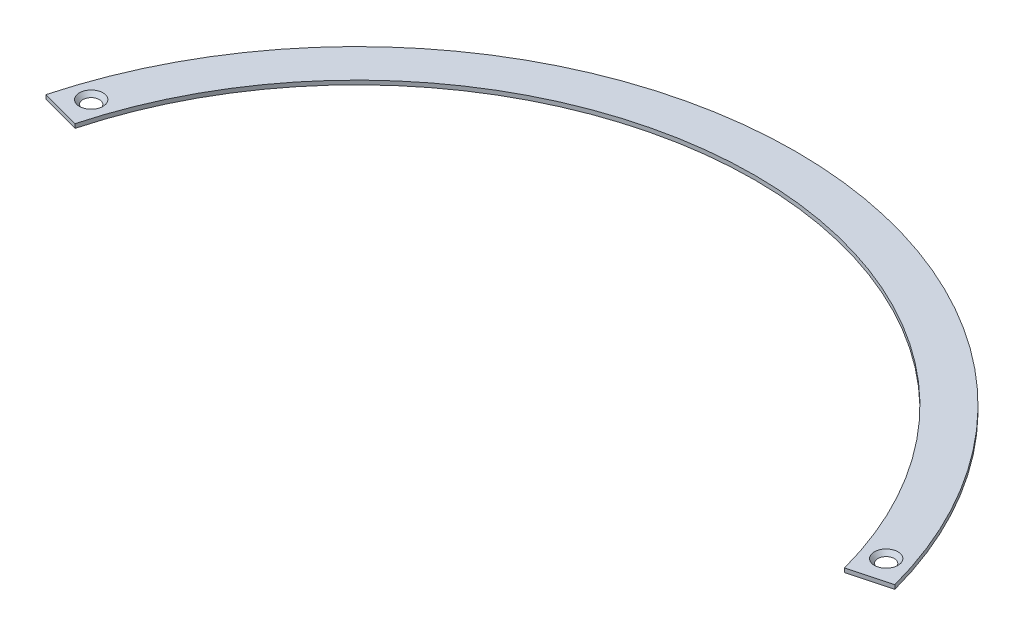
ISO-10303-21;
HEADER;
FILE_DESCRIPTION(('STEP AP214'),'2;1');
FILE_NAME('part.step','',(''),(''),'','','');
FILE_SCHEMA(('AUTOMOTIVE_DESIGN { 1 0 10303 214 1 1 1 1 }'));
ENDSEC;
DATA;
#1=APPLICATION_CONTEXT('core data for automotive mechanical design processes');
#2=APPLICATION_PROTOCOL_DEFINITION('international standard','automotive_design',2000,#1);
#3=PRODUCT_CONTEXT('',#1,'mechanical');
#4=PRODUCT('Part','Part','',(#3));
#5=PRODUCT_RELATED_PRODUCT_CATEGORY('part','',(#4));
#6=PRODUCT_DEFINITION_FORMATION('','',#4);
#7=PRODUCT_DEFINITION_CONTEXT('part definition',#1,'design');
#8=PRODUCT_DEFINITION('design','',#6,#7);
#9=PRODUCT_DEFINITION_SHAPE('','',#8);
#10=(LENGTH_UNIT() NAMED_UNIT(*) SI_UNIT(.MILLI.,.METRE.));
#11=(NAMED_UNIT(*) PLANE_ANGLE_UNIT() SI_UNIT($,.RADIAN.));
#12=(NAMED_UNIT(*) SI_UNIT($,.STERADIAN.) SOLID_ANGLE_UNIT());
#13=UNCERTAINTY_MEASURE_WITH_UNIT(LENGTH_MEASURE(1.E-05),#10,'distance_accuracy_value','');
#14=(GEOMETRIC_REPRESENTATION_CONTEXT(3) GLOBAL_UNCERTAINTY_ASSIGNED_CONTEXT((#13)) GLOBAL_UNIT_ASSIGNED_CONTEXT((#10,
#11,#12)) REPRESENTATION_CONTEXT('',''));
#15=CARTESIAN_POINT('',(0.,0.,0.));
#16=DIRECTION('',(0.,0.,1.));
#17=DIRECTION('',(1.,0.,0.));
#18=AXIS2_PLACEMENT_3D('',#15,#16,#17);
#19=CARTESIAN_POINT('',(0.,0.,0.));
#20=DIRECTION('',(0.,-1.,0.));
#21=DIRECTION('',(0.,0.,-1.));
#22=AXIS2_PLACEMENT_3D('',#19,#20,#21);
#23=PLANE('',#22);
#24=CARTESIAN_POINT('',(-153.672753253887,0.,-51.0332296878226));
#25=DIRECTION('',(0.,-1.,0.));
#26=DIRECTION('',(0.,0.,-1.));
#27=AXIS2_PLACEMENT_3D('',#24,#25,#26);
#28=CIRCLE('',#27,3.17930730371673);
#29=CARTESIAN_POINT('',(-153.672753253887,0.,-54.2125369915393));
#30=VERTEX_POINT('',#29);
#31=EDGE_CURVE('E114',#30,#30,#28,.T.);
#32=ORIENTED_EDGE('',*,*,#31,.F.);
#33=EDGE_LOOP('',(#32));
#34=FACE_BOUND('',#33,.T.);
#35=CARTESIAN_POINT('',(0.,0.,0.));
#36=DIRECTION('',(0.,-1.,0.));
#37=DIRECTION('',(0.,0.,-1.));
#38=AXIS2_PLACEMENT_3D('',#35,#36,#37);
#39=CIRCLE('',#38,153.9875);
#40=CARTESIAN_POINT('',(-148.740503175688,0.,-39.8548977077245));
#41=VERTEX_POINT('',#40);
#42=CARTESIAN_POINT('',(148.740503175688,0.,-39.8548977077245));
#43=VERTEX_POINT('',#42);
#44=EDGE_CURVE('E98',#41,#43,#39,.T.);
#45=ORIENTED_EDGE('',*,*,#44,.F.);
#46=DIRECTION('',(0.965925826289068,0.,0.258819045102522));
#47=VECTOR('',#46,1.);
#48=CARTESIAN_POINT('',(-148.740503175688,0.,-39.8548977077245));
#49=LINE('',#48,#47);
#50=CARTESIAN_POINT('',(-164.074575668027,0.,-43.963650048727));
#51=VERTEX_POINT('',#50);
#52=EDGE_CURVE('E73',#51,#41,#49,.T.);
#53=ORIENTED_EDGE('',*,*,#52,.F.);
#54=CARTESIAN_POINT('',(0.,0.,0.));
#55=DIRECTION('',(0.,1.,0.));
#56=DIRECTION('',(0.,0.,1.));
#57=AXIS2_PLACEMENT_3D('',#54,#55,#56);
#58=CIRCLE('',#57,169.8625);
#59=CARTESIAN_POINT('',(164.074575668027,0.,-43.963650048727));
#60=VERTEX_POINT('',#59);
#61=EDGE_CURVE('E67',#60,#51,#58,.T.);
#62=ORIENTED_EDGE('',*,*,#61,.F.);
#63=DIRECTION('',(0.965925826289068,0.,-0.258819045102522));
#64=VECTOR('',#63,1.);
#65=CARTESIAN_POINT('',(164.074575668027,0.,-43.963650048727));
#66=LINE('',#65,#64);
#67=EDGE_CURVE('E89',#43,#60,#66,.T.);
#68=ORIENTED_EDGE('',*,*,#67,.F.);
#69=EDGE_LOOP('',(#45,#53,#62,#68));
#70=FACE_BOUND('',#69,.T.);
#71=CARTESIAN_POINT('',(153.672753253887,0.,-51.0332296878226));
#72=DIRECTION('',(0.,-1.,0.));
#73=DIRECTION('',(0.,0.,-1.));
#74=AXIS2_PLACEMENT_3D('',#71,#72,#73);
#75=CIRCLE('',#74,3.17930730371673);
#76=CARTESIAN_POINT('',(153.672753253887,0.,-54.2125369915394));
#77=VERTEX_POINT('',#76);
#78=EDGE_CURVE('E36',#77,#77,#75,.T.);
#79=ORIENTED_EDGE('',*,*,#78,.F.);
#80=EDGE_LOOP('',(#79));
#81=FACE_BOUND('',#80,.T.);
#82=ADVANCED_FACE('F32',(#34,#70,#81),#23,.T.);
#83=CARTESIAN_POINT('',(0.,1.5875,0.));
#84=DIRECTION('',(0.,-1.,0.));
#85=DIRECTION('',(0.,0.,-1.));
#86=AXIS2_PLACEMENT_3D('',#83,#84,#85);
#87=CYLINDRICAL_SURFACE('',#86,153.9875);
#88=ORIENTED_EDGE('',*,*,#44,.T.);
#89=DIRECTION('',(0.,-1.,0.));
#90=VECTOR('',#89,1.);
#91=CARTESIAN_POINT('',(148.740503175688,1.5875,-39.8548977077245));
#92=LINE('',#91,#90);
#93=CARTESIAN_POINT('',(148.740503175688,1.5875,-39.8548977077245));
#94=VERTEX_POINT('',#93);
#95=EDGE_CURVE('E11',#94,#43,#92,.T.);
#96=ORIENTED_EDGE('',*,*,#95,.F.);
#97=CARTESIAN_POINT('',(0.,1.5875,0.));
#98=DIRECTION('',(0.,-1.,0.));
#99=DIRECTION('',(0.,0.,-1.));
#100=AXIS2_PLACEMENT_3D('',#97,#98,#99);
#101=CIRCLE('',#100,153.9875);
#102=CARTESIAN_POINT('',(-148.740503175688,1.5875,-39.8548977077245));
#103=VERTEX_POINT('',#102);
#104=EDGE_CURVE('E85',#103,#94,#101,.T.);
#105=ORIENTED_EDGE('',*,*,#104,.F.);
#106=DIRECTION('',(0.,-1.,0.));
#107=VECTOR('',#106,1.);
#108=CARTESIAN_POINT('',(-148.740503175688,1.5875,-39.8548977077245));
#109=LINE('',#108,#107);
#110=EDGE_CURVE('E94',#103,#41,#109,.T.);
#111=ORIENTED_EDGE('',*,*,#110,.T.);
#112=EDGE_LOOP('',(#88,#96,#105,#111));
#113=FACE_BOUND('',#112,.T.);
#114=ADVANCED_FACE('F34',(#113),#87,.F.);
#115=CARTESIAN_POINT('',(164.074575668027,1.5875,-43.963650048727));
#116=DIRECTION('',(-0.258819045102522,0.,-0.965925826289068));
#117=DIRECTION('',(-0.965925826289068,0.,0.258819045102522));
#118=AXIS2_PLACEMENT_3D('',#115,#116,#117);
#119=PLANE('',#118);
#120=ORIENTED_EDGE('',*,*,#67,.T.);
#121=DIRECTION('',(0.,-1.,0.));
#122=VECTOR('',#121,1.);
#123=CARTESIAN_POINT('',(164.074575668027,1.5875,-43.963650048727));
#124=LINE('',#123,#122);
#125=CARTESIAN_POINT('',(164.074575668027,1.5875,-43.963650048727));
#126=VERTEX_POINT('',#125);
#127=EDGE_CURVE('E42',#126,#60,#124,.T.);
#128=ORIENTED_EDGE('',*,*,#127,.F.);
#129=DIRECTION('',(0.965925826289068,0.,-0.258819045102522));
#130=VECTOR('',#129,1.);
#131=CARTESIAN_POINT('',(164.074575668027,1.5875,-43.963650048727));
#132=LINE('',#131,#130);
#133=EDGE_CURVE('E80',#94,#126,#132,.T.);
#134=ORIENTED_EDGE('',*,*,#133,.F.);
#135=ORIENTED_EDGE('',*,*,#95,.T.);
#136=EDGE_LOOP('',(#120,#128,#134,#135));
#137=FACE_BOUND('',#136,.T.);
#138=ADVANCED_FACE('F88',(#137),#119,.F.);
#139=CARTESIAN_POINT('',(0.,1.5875,0.));
#140=DIRECTION('',(0.,-1.,0.));
#141=DIRECTION('',(0.,0.,-1.));
#142=AXIS2_PLACEMENT_3D('',#139,#140,#141);
#143=CYLINDRICAL_SURFACE('',#142,169.8625);
#144=ORIENTED_EDGE('',*,*,#61,.T.);
#145=DIRECTION('',(0.,-1.,0.));
#146=VECTOR('',#145,1.);
#147=CARTESIAN_POINT('',(-164.074575668027,1.5875,-43.963650048727));
#148=LINE('',#147,#146);
#149=CARTESIAN_POINT('',(-164.074575668027,1.5875,-43.963650048727));
#150=VERTEX_POINT('',#149);
#151=EDGE_CURVE('E90',#150,#51,#148,.T.);
#152=ORIENTED_EDGE('',*,*,#151,.F.);
#153=CARTESIAN_POINT('',(0.,1.5875,0.));
#154=DIRECTION('',(0.,1.,0.));
#155=DIRECTION('',(0.,0.,1.));
#156=AXIS2_PLACEMENT_3D('',#153,#154,#155);
#157=CIRCLE('',#156,169.8625);
#158=EDGE_CURVE('E83',#126,#150,#157,.T.);
#159=ORIENTED_EDGE('',*,*,#158,.F.);
#160=ORIENTED_EDGE('',*,*,#127,.T.);
#161=EDGE_LOOP('',(#144,#152,#159,#160));
#162=FACE_BOUND('',#161,.T.);
#163=ADVANCED_FACE('F92',(#162),#143,.T.);
#164=CARTESIAN_POINT('',(-148.740503175688,1.5875,-39.8548977077245));
#165=DIRECTION('',(0.258819045102522,0.,-0.965925826289068));
#166=DIRECTION('',(-0.965925826289068,0.,-0.258819045102522));
#167=AXIS2_PLACEMENT_3D('',#164,#165,#166);
#168=PLANE('',#167);
#169=ORIENTED_EDGE('',*,*,#52,.T.);
#170=ORIENTED_EDGE('',*,*,#110,.F.);
#171=DIRECTION('',(0.965925826289068,0.,0.258819045102522));
#172=VECTOR('',#171,1.);
#173=CARTESIAN_POINT('',(-148.740503175688,1.5875,-39.8548977077245));
#174=LINE('',#173,#172);
#175=EDGE_CURVE('E50',#150,#103,#174,.T.);
#176=ORIENTED_EDGE('',*,*,#175,.F.);
#177=ORIENTED_EDGE('',*,*,#151,.T.);
#178=EDGE_LOOP('',(#169,#170,#176,#177));
#179=FACE_BOUND('',#178,.T.);
#180=ADVANCED_FACE('F105',(#179),#168,.F.);
#181=CARTESIAN_POINT('',(0.,1.5875,0.));
#182=DIRECTION('',(0.,-1.,0.));
#183=DIRECTION('',(0.,0.,-1.));
#184=AXIS2_PLACEMENT_3D('',#181,#182,#183);
#185=PLANE('',#184);
#186=CARTESIAN_POINT('',(-153.672753253887,1.5875,-51.0332296878226));
#187=DIRECTION('',(0.,1.,0.));
#188=DIRECTION('',(0.,0.,1.));
#189=AXIS2_PLACEMENT_3D('',#186,#187,#188);
#190=CIRCLE('',#189,4.55929999999999);
#191=CARTESIAN_POINT('',(-153.672753253887,1.5875,-46.4739296878226));
#192=VERTEX_POINT('',#191);
#193=EDGE_CURVE('E117',#192,#192,#190,.T.);
#194=ORIENTED_EDGE('',*,*,#193,.F.);
#195=EDGE_LOOP('',(#194));
#196=FACE_BOUND('',#195,.T.);
#197=CARTESIAN_POINT('',(153.672753253887,1.5875,-51.0332296878226));
#198=DIRECTION('',(0.,1.,0.));
#199=DIRECTION('',(0.,0.,1.));
#200=AXIS2_PLACEMENT_3D('',#197,#198,#199);
#201=CIRCLE('',#200,4.55929999999999);
#202=CARTESIAN_POINT('',(153.672753253887,1.5875,-46.4739296878226));
#203=VERTEX_POINT('',#202);
#204=EDGE_CURVE('E111',#203,#203,#201,.T.);
#205=ORIENTED_EDGE('',*,*,#204,.F.);
#206=EDGE_LOOP('',(#205));
#207=FACE_BOUND('',#206,.T.);
#208=ORIENTED_EDGE('',*,*,#104,.T.);
#209=ORIENTED_EDGE('',*,*,#133,.T.);
#210=ORIENTED_EDGE('',*,*,#158,.T.);
#211=ORIENTED_EDGE('',*,*,#175,.T.);
#212=EDGE_LOOP('',(#208,#209,#210,#211));
#213=FACE_BOUND('',#212,.T.);
#214=ADVANCED_FACE('F81',(#196,#207,#213),#185,.F.);
#215=CARTESIAN_POINT('',(153.672753253887,1.5875,-51.0332296878226));
#216=DIRECTION('',(0.,1.,0.));
#217=DIRECTION('',(0.,0.,1.));
#218=AXIS2_PLACEMENT_3D('',#215,#216,#217);
#219=CONICAL_SURFACE('',#218,4.55929999999999,0.715584993317673);
#220=ORIENTED_EDGE('',*,*,#78,.T.);
#221=EDGE_LOOP('',(#220));
#222=FACE_BOUND('',#221,.T.);
#223=ORIENTED_EDGE('',*,*,#204,.T.);
#224=EDGE_LOOP('',(#223));
#225=FACE_BOUND('',#224,.T.);
#226=ADVANCED_FACE('F125',(#222,#225),#219,.F.);
#227=CARTESIAN_POINT('',(-153.672753253887,1.5875,-51.0332296878226));
#228=DIRECTION('',(0.,1.,0.));
#229=DIRECTION('',(0.,0.,1.));
#230=AXIS2_PLACEMENT_3D('',#227,#228,#229);
#231=CONICAL_SURFACE('',#230,4.55929999999999,0.715584993317673);
#232=ORIENTED_EDGE('',*,*,#31,.T.);
#233=EDGE_LOOP('',(#232));
#234=FACE_BOUND('',#233,.T.);
#235=ORIENTED_EDGE('',*,*,#193,.T.);
#236=EDGE_LOOP('',(#235));
#237=FACE_BOUND('',#236,.T.);
#238=ADVANCED_FACE('F121',(#234,#237),#231,.F.);
#239=CLOSED_SHELL('',(#82,#114,#138,#163,#180,#214,#226,#238));
#240=MANIFOLD_SOLID_BREP('B2',#239);
#241=ADVANCED_BREP_SHAPE_REPRESENTATION('',(#18,#240),#14);
#242=SHAPE_DEFINITION_REPRESENTATION(#9,#241);
ENDSEC;
END-ISO-10303-21;
